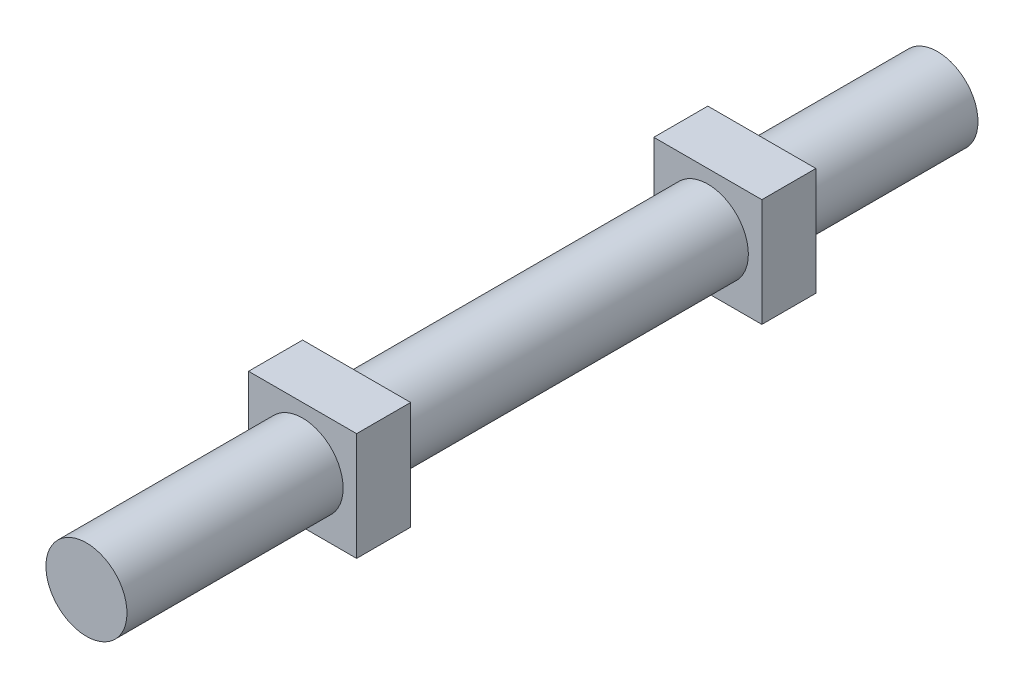
ISO-10303-21;
HEADER;
FILE_DESCRIPTION(('STEP AP214'),'2;1');
FILE_NAME('part.step','',(''),(''),'','','');
FILE_SCHEMA(('AUTOMOTIVE_DESIGN { 1 0 10303 214 1 1 1 1 }'));
ENDSEC;
DATA;
#1=APPLICATION_CONTEXT('core data for automotive mechanical design processes');
#2=APPLICATION_PROTOCOL_DEFINITION('international standard','automotive_design',2000,#1);
#3=PRODUCT_CONTEXT('',#1,'mechanical');
#4=PRODUCT('Part','Part','',(#3));
#5=PRODUCT_RELATED_PRODUCT_CATEGORY('part','',(#4));
#6=PRODUCT_DEFINITION_FORMATION('','',#4);
#7=PRODUCT_DEFINITION_CONTEXT('part definition',#1,'design');
#8=PRODUCT_DEFINITION('design','',#6,#7);
#9=PRODUCT_DEFINITION_SHAPE('','',#8);
#10=(LENGTH_UNIT() NAMED_UNIT(*) SI_UNIT(.MILLI.,.METRE.));
#11=(NAMED_UNIT(*) PLANE_ANGLE_UNIT() SI_UNIT($,.RADIAN.));
#12=(NAMED_UNIT(*) SI_UNIT($,.STERADIAN.) SOLID_ANGLE_UNIT());
#13=UNCERTAINTY_MEASURE_WITH_UNIT(LENGTH_MEASURE(1.E-05),#10,'distance_accuracy_value','');
#14=(GEOMETRIC_REPRESENTATION_CONTEXT(3) GLOBAL_UNCERTAINTY_ASSIGNED_CONTEXT((#13)) GLOBAL_UNIT_ASSIGNED_CONTEXT((#10,
#11,#12)) REPRESENTATION_CONTEXT('',''));
#15=CARTESIAN_POINT('',(0.,0.,0.));
#16=DIRECTION('',(0.,0.,1.));
#17=DIRECTION('',(1.,0.,0.));
#18=AXIS2_PLACEMENT_3D('',#15,#16,#17);
#19=CARTESIAN_POINT('',(0.,0.,157.5));
#20=DIRECTION('',(0.,0.,-1.));
#21=DIRECTION('',(-1.,0.,0.));
#22=AXIS2_PLACEMENT_3D('',#19,#20,#21);
#23=CYLINDRICAL_SURFACE('',#22,7.5);
#24=CARTESIAN_POINT('',(0.,0.,117.5));
#25=DIRECTION('',(0.,0.,1.));
#26=DIRECTION('',(1.,0.,0.));
#27=AXIS2_PLACEMENT_3D('',#24,#25,#26);
#28=CIRCLE('',#27,7.5);
#29=CARTESIAN_POINT('',(7.5,0.,117.5));
#30=VERTEX_POINT('',#29);
#31=EDGE_CURVE('E174',#30,#30,#28,.T.);
#32=ORIENTED_EDGE('',*,*,#31,.T.);
#33=EDGE_LOOP('',(#32));
#34=FACE_BOUND('',#33,.T.);
#35=CARTESIAN_POINT('',(0.,0.,157.5));
#36=DIRECTION('',(0.,0.,1.));
#37=DIRECTION('',(1.,0.,0.));
#38=AXIS2_PLACEMENT_3D('',#35,#36,#37);
#39=CIRCLE('',#38,7.5);
#40=CARTESIAN_POINT('',(7.5,0.,157.5));
#41=VERTEX_POINT('',#40);
#42=EDGE_CURVE('E175',#41,#41,#39,.T.);
#43=ORIENTED_EDGE('',*,*,#42,.F.);
#44=EDGE_LOOP('',(#43));
#45=FACE_BOUND('',#44,.T.);
#46=ADVANCED_FACE('F46',(#34,#45),#23,.T.);
#47=CARTESIAN_POINT('',(0.,0.,157.5));
#48=DIRECTION('',(0.,0.,1.));
#49=DIRECTION('',(1.,0.,0.));
#50=AXIS2_PLACEMENT_3D('',#47,#48,#49);
#51=PLANE('',#50);
#52=ORIENTED_EDGE('',*,*,#42,.T.);
#53=EDGE_LOOP('',(#52));
#54=FACE_BOUND('',#53,.T.);
#55=ADVANCED_FACE('F213',(#54),#51,.T.);
#56=CARTESIAN_POINT('',(10.,10.,117.5));
#57=DIRECTION('',(-1.,0.,0.));
#58=DIRECTION('',(0.,0.,1.));
#59=AXIS2_PLACEMENT_3D('',#56,#57,#58);
#60=PLANE('',#59);
#61=DIRECTION('',(0.,1.,0.));
#62=VECTOR('',#61,1.);
#63=CARTESIAN_POINT('',(10.,10.,107.5));
#64=LINE('',#63,#62);
#65=CARTESIAN_POINT('',(10.,-10.,107.5));
#66=VERTEX_POINT('',#65);
#67=CARTESIAN_POINT('',(10.,10.,107.5));
#68=VERTEX_POINT('',#67);
#69=EDGE_CURVE('E149',#66,#68,#64,.T.);
#70=ORIENTED_EDGE('',*,*,#69,.T.);
#71=DIRECTION('',(0.,0.,-1.));
#72=VECTOR('',#71,1.);
#73=CARTESIAN_POINT('',(10.,10.,117.5));
#74=LINE('',#73,#72);
#75=CARTESIAN_POINT('',(10.,10.,117.5));
#76=VERTEX_POINT('',#75);
#77=EDGE_CURVE('E172',#76,#68,#74,.T.);
#78=ORIENTED_EDGE('',*,*,#77,.F.);
#79=DIRECTION('',(0.,1.,0.));
#80=VECTOR('',#79,1.);
#81=CARTESIAN_POINT('',(10.,10.,117.5));
#82=LINE('',#81,#80);
#83=CARTESIAN_POINT('',(10.,-10.,117.5));
#84=VERTEX_POINT('',#83);
#85=EDGE_CURVE('E154',#84,#76,#82,.T.);
#86=ORIENTED_EDGE('',*,*,#85,.F.);
#87=DIRECTION('',(0.,0.,-1.));
#88=VECTOR('',#87,1.);
#89=CARTESIAN_POINT('',(10.,-10.,117.5));
#90=LINE('',#89,#88);
#91=EDGE_CURVE('E160',#84,#66,#90,.T.);
#92=ORIENTED_EDGE('',*,*,#91,.T.);
#93=EDGE_LOOP('',(#70,#78,#86,#92));
#94=FACE_BOUND('',#93,.T.);
#95=ADVANCED_FACE('F196',(#94),#60,.F.);
#96=CARTESIAN_POINT('',(-10.,10.,117.5));
#97=DIRECTION('',(0.,-1.,0.));
#98=DIRECTION('',(0.,0.,-1.));
#99=AXIS2_PLACEMENT_3D('',#96,#97,#98);
#100=PLANE('',#99);
#101=DIRECTION('',(-1.,0.,0.));
#102=VECTOR('',#101,1.);
#103=CARTESIAN_POINT('',(-10.,10.,107.5));
#104=LINE('',#103,#102);
#105=CARTESIAN_POINT('',(-10.,10.,107.5));
#106=VERTEX_POINT('',#105);
#107=EDGE_CURVE('E163',#68,#106,#104,.T.);
#108=ORIENTED_EDGE('',*,*,#107,.T.);
#109=DIRECTION('',(0.,0.,-1.));
#110=VECTOR('',#109,1.);
#111=CARTESIAN_POINT('',(-10.,10.,117.5));
#112=LINE('',#111,#110);
#113=CARTESIAN_POINT('',(-10.,10.,117.5));
#114=VERTEX_POINT('',#113);
#115=EDGE_CURVE('E170',#114,#106,#112,.T.);
#116=ORIENTED_EDGE('',*,*,#115,.F.);
#117=DIRECTION('',(-1.,0.,0.));
#118=VECTOR('',#117,1.);
#119=CARTESIAN_POINT('',(-10.,10.,117.5));
#120=LINE('',#119,#118);
#121=EDGE_CURVE('E95',#76,#114,#120,.T.);
#122=ORIENTED_EDGE('',*,*,#121,.F.);
#123=ORIENTED_EDGE('',*,*,#77,.T.);
#124=EDGE_LOOP('',(#108,#116,#122,#123));
#125=FACE_BOUND('',#124,.T.);
#126=ADVANCED_FACE('F198',(#125),#100,.F.);
#127=CARTESIAN_POINT('',(-10.,10.,117.5));
#128=DIRECTION('',(1.,0.,0.));
#129=DIRECTION('',(0.,1.,0.));
#130=AXIS2_PLACEMENT_3D('',#127,#128,#129);
#131=PLANE('',#130);
#132=DIRECTION('',(0.,-1.,0.));
#133=VECTOR('',#132,1.);
#134=CARTESIAN_POINT('',(-10.,10.,107.5));
#135=LINE('',#134,#133);
#136=CARTESIAN_POINT('',(-10.,-10.,107.5));
#137=VERTEX_POINT('',#136);
#138=EDGE_CURVE('E81',#106,#137,#135,.T.);
#139=ORIENTED_EDGE('',*,*,#138,.T.);
#140=DIRECTION('',(0.,0.,-1.));
#141=VECTOR('',#140,1.);
#142=CARTESIAN_POINT('',(-10.,-10.,117.5));
#143=LINE('',#142,#141);
#144=CARTESIAN_POINT('',(-10.,-10.,117.5));
#145=VERTEX_POINT('',#144);
#146=EDGE_CURVE('E168',#145,#137,#143,.T.);
#147=ORIENTED_EDGE('',*,*,#146,.F.);
#148=DIRECTION('',(0.,-1.,0.));
#149=VECTOR('',#148,1.);
#150=CARTESIAN_POINT('',(-10.,10.,117.5));
#151=LINE('',#150,#149);
#152=EDGE_CURVE('E157',#114,#145,#151,.T.);
#153=ORIENTED_EDGE('',*,*,#152,.F.);
#154=ORIENTED_EDGE('',*,*,#115,.T.);
#155=EDGE_LOOP('',(#139,#147,#153,#154));
#156=FACE_BOUND('',#155,.T.);
#157=ADVANCED_FACE('F201',(#156),#131,.F.);
#158=CARTESIAN_POINT('',(-10.,-10.,117.5));
#159=DIRECTION('',(0.,1.,0.));
#160=DIRECTION('',(0.,0.,1.));
#161=AXIS2_PLACEMENT_3D('',#158,#159,#160);
#162=PLANE('',#161);
#163=DIRECTION('',(1.,0.,0.));
#164=VECTOR('',#163,1.);
#165=CARTESIAN_POINT('',(-10.,-10.,107.5));
#166=LINE('',#165,#164);
#167=EDGE_CURVE('E87',#137,#66,#166,.T.);
#168=ORIENTED_EDGE('',*,*,#167,.T.);
#169=ORIENTED_EDGE('',*,*,#91,.F.);
#170=DIRECTION('',(1.,0.,0.));
#171=VECTOR('',#170,1.);
#172=CARTESIAN_POINT('',(-10.,-10.,117.5));
#173=LINE('',#172,#171);
#174=EDGE_CURVE('E63',#145,#84,#173,.T.);
#175=ORIENTED_EDGE('',*,*,#174,.F.);
#176=ORIENTED_EDGE('',*,*,#146,.T.);
#177=EDGE_LOOP('',(#168,#169,#175,#176));
#178=FACE_BOUND('',#177,.T.);
#179=ADVANCED_FACE('F191',(#178),#162,.F.);
#180=CARTESIAN_POINT('',(0.,0.,117.5));
#181=DIRECTION('',(0.,0.,1.));
#182=DIRECTION('',(1.,0.,0.));
#183=AXIS2_PLACEMENT_3D('',#180,#181,#182);
#184=PLANE('',#183);
#185=ORIENTED_EDGE('',*,*,#31,.F.);
#186=EDGE_LOOP('',(#185));
#187=FACE_BOUND('',#186,.T.);
#188=ORIENTED_EDGE('',*,*,#85,.T.);
#189=ORIENTED_EDGE('',*,*,#121,.T.);
#190=ORIENTED_EDGE('',*,*,#152,.T.);
#191=ORIENTED_EDGE('',*,*,#174,.T.);
#192=EDGE_LOOP('',(#188,#189,#190,#191));
#193=FACE_BOUND('',#192,.T.);
#194=ADVANCED_FACE('F188',(#187,#193),#184,.T.);
#195=CARTESIAN_POINT('',(0.,0.,107.5));
#196=DIRECTION('',(0.,0.,1.));
#197=DIRECTION('',(1.,0.,0.));
#198=AXIS2_PLACEMENT_3D('',#195,#196,#197);
#199=PLANE('',#198);
#200=CARTESIAN_POINT('',(0.,0.,107.5));
#201=DIRECTION('',(0.,0.,1.));
#202=DIRECTION('',(1.,0.,0.));
#203=AXIS2_PLACEMENT_3D('',#200,#201,#202);
#204=CIRCLE('',#203,7.5);
#205=CARTESIAN_POINT('',(7.5,0.,107.5));
#206=VERTEX_POINT('',#205);
#207=EDGE_CURVE('E55',#206,#206,#204,.T.);
#208=ORIENTED_EDGE('',*,*,#207,.T.);
#209=EDGE_LOOP('',(#208));
#210=FACE_BOUND('',#209,.T.);
#211=ORIENTED_EDGE('',*,*,#69,.F.);
#212=ORIENTED_EDGE('',*,*,#167,.F.);
#213=ORIENTED_EDGE('',*,*,#138,.F.);
#214=ORIENTED_EDGE('',*,*,#107,.F.);
#215=EDGE_LOOP('',(#211,#212,#213,#214));
#216=FACE_BOUND('',#215,.T.);
#217=ADVANCED_FACE('F190',(#210,#216),#199,.F.);
#218=CARTESIAN_POINT('',(0.,0.,42.5));
#219=DIRECTION('',(0.,0.,1.));
#220=DIRECTION('',(1.,0.,0.));
#221=AXIS2_PLACEMENT_3D('',#218,#219,#220);
#222=CIRCLE('',#221,7.5);
#223=CARTESIAN_POINT('',(7.5,0.,42.5));
#224=VERTEX_POINT('',#223);
#225=EDGE_CURVE('E49',#224,#224,#222,.T.);
#226=ORIENTED_EDGE('',*,*,#225,.T.);
#227=EDGE_LOOP('',(#226));
#228=FACE_BOUND('',#227,.T.);
#229=ORIENTED_EDGE('',*,*,#207,.F.);
#230=EDGE_LOOP('',(#229));
#231=FACE_BOUND('',#230,.T.);
#232=ADVANCED_FACE('F203',(#228,#231),#23,.T.);
#233=CARTESIAN_POINT('',(10.,10.,42.5));
#234=DIRECTION('',(-1.,0.,0.));
#235=DIRECTION('',(0.,0.,1.));
#236=AXIS2_PLACEMENT_3D('',#233,#234,#235);
#237=PLANE('',#236);
#238=DIRECTION('',(0.,1.,0.));
#239=VECTOR('',#238,1.);
#240=CARTESIAN_POINT('',(10.,10.,32.5));
#241=LINE('',#240,#239);
#242=CARTESIAN_POINT('',(10.,-10.,32.5));
#243=VERTEX_POINT('',#242);
#244=CARTESIAN_POINT('',(10.,10.,32.5));
#245=VERTEX_POINT('',#244);
#246=EDGE_CURVE('E146',#243,#245,#241,.T.);
#247=ORIENTED_EDGE('',*,*,#246,.T.);
#248=DIRECTION('',(0.,0.,-1.));
#249=VECTOR('',#248,1.);
#250=CARTESIAN_POINT('',(10.,10.,42.5));
#251=LINE('',#250,#249);
#252=CARTESIAN_POINT('',(10.,10.,42.5));
#253=VERTEX_POINT('',#252);
#254=EDGE_CURVE('E126',#253,#245,#251,.T.);
#255=ORIENTED_EDGE('',*,*,#254,.F.);
#256=DIRECTION('',(0.,1.,0.));
#257=VECTOR('',#256,1.);
#258=CARTESIAN_POINT('',(10.,10.,42.5));
#259=LINE('',#258,#257);
#260=CARTESIAN_POINT('',(10.,-10.,42.5));
#261=VERTEX_POINT('',#260);
#262=EDGE_CURVE('E133',#261,#253,#259,.T.);
#263=ORIENTED_EDGE('',*,*,#262,.F.);
#264=DIRECTION('',(0.,0.,-1.));
#265=VECTOR('',#264,1.);
#266=CARTESIAN_POINT('',(10.,-10.,42.5));
#267=LINE('',#266,#265);
#268=EDGE_CURVE('E245',#261,#243,#267,.T.);
#269=ORIENTED_EDGE('',*,*,#268,.T.);
#270=EDGE_LOOP('',(#247,#255,#263,#269));
#271=FACE_BOUND('',#270,.T.);
#272=ADVANCED_FACE('F144',(#271),#237,.F.);
#273=CARTESIAN_POINT('',(-10.,10.,42.5));
#274=DIRECTION('',(0.,-1.,0.));
#275=DIRECTION('',(0.,0.,-1.));
#276=AXIS2_PLACEMENT_3D('',#273,#274,#275);
#277=PLANE('',#276);
#278=DIRECTION('',(-1.,0.,0.));
#279=VECTOR('',#278,1.);
#280=CARTESIAN_POINT('',(-10.,10.,32.5));
#281=LINE('',#280,#279);
#282=CARTESIAN_POINT('',(-10.,10.,32.5));
#283=VERTEX_POINT('',#282);
#284=EDGE_CURVE('E236',#245,#283,#281,.T.);
#285=ORIENTED_EDGE('',*,*,#284,.T.);
#286=DIRECTION('',(0.,0.,-1.));
#287=VECTOR('',#286,1.);
#288=CARTESIAN_POINT('',(-10.,10.,42.5));
#289=LINE('',#288,#287);
#290=CARTESIAN_POINT('',(-10.,10.,42.5));
#291=VERTEX_POINT('',#290);
#292=EDGE_CURVE('E129',#291,#283,#289,.T.);
#293=ORIENTED_EDGE('',*,*,#292,.F.);
#294=DIRECTION('',(-1.,0.,0.));
#295=VECTOR('',#294,1.);
#296=CARTESIAN_POINT('',(-10.,10.,42.5));
#297=LINE('',#296,#295);
#298=EDGE_CURVE('E122',#253,#291,#297,.T.);
#299=ORIENTED_EDGE('',*,*,#298,.F.);
#300=ORIENTED_EDGE('',*,*,#254,.T.);
#301=EDGE_LOOP('',(#285,#293,#299,#300));
#302=FACE_BOUND('',#301,.T.);
#303=ADVANCED_FACE('F124',(#302),#277,.F.);
#304=CARTESIAN_POINT('',(-10.,10.,42.5));
#305=DIRECTION('',(1.,0.,0.));
#306=DIRECTION('',(0.,0.,-1.));
#307=AXIS2_PLACEMENT_3D('',#304,#305,#306);
#308=PLANE('',#307);
#309=DIRECTION('',(0.,-1.,0.));
#310=VECTOR('',#309,1.);
#311=CARTESIAN_POINT('',(-10.,10.,32.5));
#312=LINE('',#311,#310);
#313=CARTESIAN_POINT('',(-10.,-10.,32.5));
#314=VERTEX_POINT('',#313);
#315=EDGE_CURVE('E238',#283,#314,#312,.T.);
#316=ORIENTED_EDGE('',*,*,#315,.T.);
#317=DIRECTION('',(0.,0.,-1.));
#318=VECTOR('',#317,1.);
#319=CARTESIAN_POINT('',(-10.,-10.,42.5));
#320=LINE('',#319,#318);
#321=CARTESIAN_POINT('',(-10.,-10.,42.5));
#322=VERTEX_POINT('',#321);
#323=EDGE_CURVE('E150',#322,#314,#320,.T.);
#324=ORIENTED_EDGE('',*,*,#323,.F.);
#325=DIRECTION('',(0.,-1.,0.));
#326=VECTOR('',#325,1.);
#327=CARTESIAN_POINT('',(-10.,10.,42.5));
#328=LINE('',#327,#326);
#329=EDGE_CURVE('E132',#291,#322,#328,.T.);
#330=ORIENTED_EDGE('',*,*,#329,.F.);
#331=ORIENTED_EDGE('',*,*,#292,.T.);
#332=EDGE_LOOP('',(#316,#324,#330,#331));
#333=FACE_BOUND('',#332,.T.);
#334=ADVANCED_FACE('F251',(#333),#308,.F.);
#335=CARTESIAN_POINT('',(-10.,-10.,42.5));
#336=DIRECTION('',(0.,1.,0.));
#337=DIRECTION('',(0.,0.,1.));
#338=AXIS2_PLACEMENT_3D('',#335,#336,#337);
#339=PLANE('',#338);
#340=DIRECTION('',(1.,0.,0.));
#341=VECTOR('',#340,1.);
#342=CARTESIAN_POINT('',(-10.,-10.,32.5));
#343=LINE('',#342,#341);
#344=EDGE_CURVE('E142',#314,#243,#343,.T.);
#345=ORIENTED_EDGE('',*,*,#344,.T.);
#346=ORIENTED_EDGE('',*,*,#268,.F.);
#347=DIRECTION('',(1.,0.,0.));
#348=VECTOR('',#347,1.);
#349=CARTESIAN_POINT('',(-10.,-10.,42.5));
#350=LINE('',#349,#348);
#351=EDGE_CURVE('E138',#322,#261,#350,.T.);
#352=ORIENTED_EDGE('',*,*,#351,.F.);
#353=ORIENTED_EDGE('',*,*,#323,.T.);
#354=EDGE_LOOP('',(#345,#346,#352,#353));
#355=FACE_BOUND('',#354,.T.);
#356=ADVANCED_FACE('F249',(#355),#339,.F.);
#357=CARTESIAN_POINT('',(0.,0.,42.5));
#358=DIRECTION('',(0.,0.,1.));
#359=DIRECTION('',(1.,0.,0.));
#360=AXIS2_PLACEMENT_3D('',#357,#358,#359);
#361=PLANE('',#360);
#362=ORIENTED_EDGE('',*,*,#225,.F.);
#363=EDGE_LOOP('',(#362));
#364=FACE_BOUND('',#363,.T.);
#365=ORIENTED_EDGE('',*,*,#262,.T.);
#366=ORIENTED_EDGE('',*,*,#298,.T.);
#367=ORIENTED_EDGE('',*,*,#329,.T.);
#368=ORIENTED_EDGE('',*,*,#351,.T.);
#369=EDGE_LOOP('',(#365,#366,#367,#368));
#370=FACE_BOUND('',#369,.T.);
#371=ADVANCED_FACE('F136',(#364,#370),#361,.T.);
#372=CARTESIAN_POINT('',(0.,0.,32.5));
#373=DIRECTION('',(0.,0.,1.));
#374=DIRECTION('',(1.,0.,0.));
#375=AXIS2_PLACEMENT_3D('',#372,#373,#374);
#376=PLANE('',#375);
#377=CARTESIAN_POINT('',(0.,0.,32.5));
#378=DIRECTION('',(0.,0.,1.));
#379=DIRECTION('',(1.,0.,0.));
#380=AXIS2_PLACEMENT_3D('',#377,#378,#379);
#381=CIRCLE('',#380,7.5);
#382=CARTESIAN_POINT('',(7.5,0.,32.5));
#383=VERTEX_POINT('',#382);
#384=EDGE_CURVE('E11',#383,#383,#381,.T.);
#385=ORIENTED_EDGE('',*,*,#384,.T.);
#386=EDGE_LOOP('',(#385));
#387=FACE_BOUND('',#386,.T.);
#388=ORIENTED_EDGE('',*,*,#246,.F.);
#389=ORIENTED_EDGE('',*,*,#344,.F.);
#390=ORIENTED_EDGE('',*,*,#315,.F.);
#391=ORIENTED_EDGE('',*,*,#284,.F.);
#392=EDGE_LOOP('',(#388,#389,#390,#391));
#393=FACE_BOUND('',#392,.T.);
#394=ADVANCED_FACE('F225',(#387,#393),#376,.F.);
#395=CARTESIAN_POINT('',(0.,0.,0.));
#396=DIRECTION('',(0.,0.,1.));
#397=DIRECTION('',(1.,0.,0.));
#398=AXIS2_PLACEMENT_3D('',#395,#396,#397);
#399=PLANE('',#398);
#400=CARTESIAN_POINT('',(0.,0.,0.));
#401=DIRECTION('',(0.,0.,1.));
#402=DIRECTION('',(1.,0.,0.));
#403=AXIS2_PLACEMENT_3D('',#400,#401,#402);
#404=CIRCLE('',#403,7.5);
#405=CARTESIAN_POINT('',(7.5,0.,0.));
#406=VERTEX_POINT('',#405);
#407=EDGE_CURVE('E178',#406,#406,#404,.T.);
#408=ORIENTED_EDGE('',*,*,#407,.F.);
#409=EDGE_LOOP('',(#408));
#410=FACE_BOUND('',#409,.T.);
#411=ADVANCED_FACE('F220',(#410),#399,.F.);
#412=ORIENTED_EDGE('',*,*,#407,.T.);
#413=EDGE_LOOP('',(#412));
#414=FACE_BOUND('',#413,.T.);
#415=ORIENTED_EDGE('',*,*,#384,.F.);
#416=EDGE_LOOP('',(#415));
#417=FACE_BOUND('',#416,.T.);
#418=ADVANCED_FACE('F210',(#414,#417),#23,.T.);
#419=CLOSED_SHELL('',(#46,#55,#95,#126,#157,#179,#194,#217,#232,#272,#303,#334,#356,#371,#394,
#411,#418));
#420=MANIFOLD_SOLID_BREP('B2',#419);
#421=ADVANCED_BREP_SHAPE_REPRESENTATION('',(#18,#420),#14);
#422=SHAPE_DEFINITION_REPRESENTATION(#9,#421);
ENDSEC;
END-ISO-10303-21;
